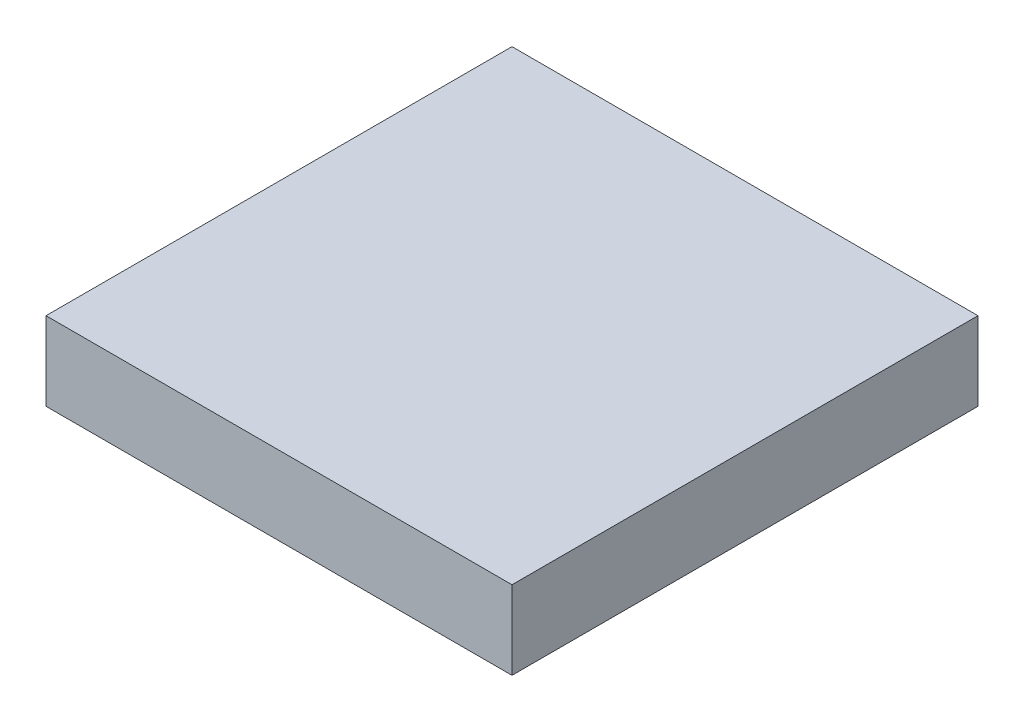
ISO-10303-21;
HEADER;
FILE_DESCRIPTION(('STEP AP214'),'2;1');
FILE_NAME('part.step','',(''),(''),'','','');
FILE_SCHEMA(('AUTOMOTIVE_DESIGN { 1 0 10303 214 1 1 1 1 }'));
ENDSEC;
DATA;
#1=APPLICATION_CONTEXT('core data for automotive mechanical design processes');
#2=APPLICATION_PROTOCOL_DEFINITION('international standard','automotive_design',2000,#1);
#3=PRODUCT_CONTEXT('',#1,'mechanical');
#4=PRODUCT('Part','Part','',(#3));
#5=PRODUCT_RELATED_PRODUCT_CATEGORY('part','',(#4));
#6=PRODUCT_DEFINITION_FORMATION('','',#4);
#7=PRODUCT_DEFINITION_CONTEXT('part definition',#1,'design');
#8=PRODUCT_DEFINITION('design','',#6,#7);
#9=PRODUCT_DEFINITION_SHAPE('','',#8);
#10=(LENGTH_UNIT() NAMED_UNIT(*) SI_UNIT(.MILLI.,.METRE.));
#11=(NAMED_UNIT(*) PLANE_ANGLE_UNIT() SI_UNIT($,.RADIAN.));
#12=(NAMED_UNIT(*) SI_UNIT($,.STERADIAN.) SOLID_ANGLE_UNIT());
#13=UNCERTAINTY_MEASURE_WITH_UNIT(LENGTH_MEASURE(1.E-05),#10,'distance_accuracy_value','');
#14=(GEOMETRIC_REPRESENTATION_CONTEXT(3) GLOBAL_UNCERTAINTY_ASSIGNED_CONTEXT((#13)) GLOBAL_UNIT_ASSIGNED_CONTEXT((#10,
#11,#12)) REPRESENTATION_CONTEXT('',''));
#15=CARTESIAN_POINT('',(0.,0.,0.));
#16=DIRECTION('',(0.,0.,1.));
#17=DIRECTION('',(1.,0.,0.));
#18=AXIS2_PLACEMENT_3D('',#15,#16,#17);
#19=CARTESIAN_POINT('',(363.498182619916,99.4218000310896,7.34009304640788));
#20=DIRECTION('',(1.,0.,0.));
#21=DIRECTION('',(0.,0.,-1.));
#22=AXIS2_PLACEMENT_3D('',#19,#20,#21);
#23=PLANE('',#22);
#24=DIRECTION('',(0.,0.,1.));
#25=VECTOR('',#24,1.);
#26=CARTESIAN_POINT('',(363.498182619916,90.5892800165049,7.34009304640788));
#27=LINE('',#26,#25);
#28=CARTESIAN_POINT('',(363.498182619916,90.5892800165049,7.34009304640788));
#29=VERTEX_POINT('',#28);
#30=CARTESIAN_POINT('',(363.498182619916,90.5892800165049,59.7825908800285));
#31=VERTEX_POINT('',#30);
#32=EDGE_CURVE('E79',#29,#31,#27,.T.);
#33=ORIENTED_EDGE('',*,*,#32,.F.);
#34=DIRECTION('',(0.,-1.,0.));
#35=VECTOR('',#34,1.);
#36=CARTESIAN_POINT('',(363.498182619916,99.4218000310896,7.34009304640788));
#37=LINE('',#36,#35);
#38=CARTESIAN_POINT('',(363.498182619916,99.4218000310896,7.34009304640788));
#39=VERTEX_POINT('',#38);
#40=EDGE_CURVE('E32',#39,#29,#37,.T.);
#41=ORIENTED_EDGE('',*,*,#40,.F.);
#42=DIRECTION('',(0.,0.,1.));
#43=VECTOR('',#42,1.);
#44=CARTESIAN_POINT('',(363.498182619916,99.4218000310896,7.34009304640788));
#45=LINE('',#44,#43);
#46=CARTESIAN_POINT('',(363.498182619916,99.4218000310896,59.7825908800285));
#47=VERTEX_POINT('',#46);
#48=EDGE_CURVE('E71',#39,#47,#45,.T.);
#49=ORIENTED_EDGE('',*,*,#48,.T.);
#50=DIRECTION('',(0.,-1.,0.));
#51=VECTOR('',#50,1.);
#52=CARTESIAN_POINT('',(363.498182619916,99.4218000310896,59.7825908800285));
#53=LINE('',#52,#51);
#54=EDGE_CURVE('E10',#47,#31,#53,.T.);
#55=ORIENTED_EDGE('',*,*,#54,.T.);
#56=EDGE_LOOP('',(#33,#41,#49,#55));
#57=FACE_BOUND('',#56,.T.);
#58=ADVANCED_FACE('F16',(#57),#23,.T.);
#59=CARTESIAN_POINT('',(363.498182619916,99.4218000310896,59.7825908800285));
#60=DIRECTION('',(0.,0.,1.));
#61=DIRECTION('',(1.,0.,0.));
#62=AXIS2_PLACEMENT_3D('',#59,#60,#61);
#63=PLANE('',#62);
#64=DIRECTION('',(-1.,0.,0.));
#65=VECTOR('',#64,1.);
#66=CARTESIAN_POINT('',(363.498182619916,90.5892800165049,59.7825908800285));
#67=LINE('',#66,#65);
#68=CARTESIAN_POINT('',(311.055684786296,90.5892800165049,59.7825908800285));
#69=VERTEX_POINT('',#68);
#70=EDGE_CURVE('E82',#31,#69,#67,.T.);
#71=ORIENTED_EDGE('',*,*,#70,.F.);
#72=ORIENTED_EDGE('',*,*,#54,.F.);
#73=DIRECTION('',(-1.,0.,0.));
#74=VECTOR('',#73,1.);
#75=CARTESIAN_POINT('',(363.498182619916,99.4218000310896,59.7825908800285));
#76=LINE('',#75,#74);
#77=CARTESIAN_POINT('',(311.055684786296,99.4218000310896,59.7825908800285));
#78=VERTEX_POINT('',#77);
#79=EDGE_CURVE('E67',#47,#78,#76,.T.);
#80=ORIENTED_EDGE('',*,*,#79,.T.);
#81=DIRECTION('',(0.,-1.,0.));
#82=VECTOR('',#81,1.);
#83=CARTESIAN_POINT('',(311.055684786296,99.4218000310896,59.7825908800285));
#84=LINE('',#83,#82);
#85=EDGE_CURVE('E24',#78,#69,#84,.T.);
#86=ORIENTED_EDGE('',*,*,#85,.T.);
#87=EDGE_LOOP('',(#71,#72,#80,#86));
#88=FACE_BOUND('',#87,.T.);
#89=ADVANCED_FACE('F68',(#88),#63,.T.);
#90=CARTESIAN_POINT('',(311.055684786296,99.4218000310896,59.7825908800285));
#91=DIRECTION('',(-1.,0.,0.));
#92=DIRECTION('',(0.,0.,1.));
#93=AXIS2_PLACEMENT_3D('',#90,#91,#92);
#94=PLANE('',#93);
#95=DIRECTION('',(0.,0.,-1.));
#96=VECTOR('',#95,1.);
#97=CARTESIAN_POINT('',(311.055684786296,90.5892800165049,59.7825908800285));
#98=LINE('',#97,#96);
#99=CARTESIAN_POINT('',(311.055684786296,90.5892800165049,7.34009304640791));
#100=VERTEX_POINT('',#99);
#101=EDGE_CURVE('E65',#69,#100,#98,.T.);
#102=ORIENTED_EDGE('',*,*,#101,.F.);
#103=ORIENTED_EDGE('',*,*,#85,.F.);
#104=DIRECTION('',(0.,0.,-1.));
#105=VECTOR('',#104,1.);
#106=CARTESIAN_POINT('',(311.055684786296,99.4218000310896,59.7825908800285));
#107=LINE('',#106,#105);
#108=CARTESIAN_POINT('',(311.055684786296,99.4218000310896,7.34009304640791));
#109=VERTEX_POINT('',#108);
#110=EDGE_CURVE('E62',#78,#109,#107,.T.);
#111=ORIENTED_EDGE('',*,*,#110,.T.);
#112=DIRECTION('',(0.,-1.,0.));
#113=VECTOR('',#112,1.);
#114=CARTESIAN_POINT('',(311.055684786296,99.4218000310896,7.34009304640791));
#115=LINE('',#114,#113);
#116=EDGE_CURVE('E48',#109,#100,#115,.T.);
#117=ORIENTED_EDGE('',*,*,#116,.T.);
#118=EDGE_LOOP('',(#102,#103,#111,#117));
#119=FACE_BOUND('',#118,.T.);
#120=ADVANCED_FACE('F60',(#119),#94,.T.);
#121=CARTESIAN_POINT('',(311.055684786296,99.4218000310896,7.34009304640791));
#122=DIRECTION('',(0.,0.,-1.));
#123=DIRECTION('',(-1.,0.,0.));
#124=AXIS2_PLACEMENT_3D('',#121,#122,#123);
#125=PLANE('',#124);
#126=DIRECTION('',(1.,0.,0.));
#127=VECTOR('',#126,1.);
#128=CARTESIAN_POINT('',(311.055684786296,90.5892800165049,7.34009304640791));
#129=LINE('',#128,#127);
#130=EDGE_CURVE('E85',#100,#29,#129,.T.);
#131=ORIENTED_EDGE('',*,*,#130,.F.);
#132=ORIENTED_EDGE('',*,*,#116,.F.);
#133=DIRECTION('',(1.,0.,0.));
#134=VECTOR('',#133,1.);
#135=CARTESIAN_POINT('',(311.055684786296,99.4218000310896,7.34009304640791));
#136=LINE('',#135,#134);
#137=EDGE_CURVE('E74',#109,#39,#136,.T.);
#138=ORIENTED_EDGE('',*,*,#137,.T.);
#139=ORIENTED_EDGE('',*,*,#40,.T.);
#140=EDGE_LOOP('',(#131,#132,#138,#139));
#141=FACE_BOUND('',#140,.T.);
#142=ADVANCED_FACE('F96',(#141),#125,.T.);
#143=CARTESIAN_POINT('',(224.776933703106,99.4218000310896,33.5613419632182));
#144=DIRECTION('',(0.,-1.,0.));
#145=DIRECTION('',(1.,0.,0.));
#146=AXIS2_PLACEMENT_3D('',#143,#144,#145);
#147=PLANE('',#146);
#148=ORIENTED_EDGE('',*,*,#48,.F.);
#149=ORIENTED_EDGE('',*,*,#137,.F.);
#150=ORIENTED_EDGE('',*,*,#110,.F.);
#151=ORIENTED_EDGE('',*,*,#79,.F.);
#152=EDGE_LOOP('',(#148,#149,#150,#151));
#153=FACE_BOUND('',#152,.T.);
#154=ADVANCED_FACE('F73',(#153),#147,.F.);
#155=CARTESIAN_POINT('',(224.776933703106,90.5892800165049,33.5613419632182));
#156=DIRECTION('',(0.,-1.,0.));
#157=DIRECTION('',(1.,0.,0.));
#158=AXIS2_PLACEMENT_3D('',#155,#156,#157);
#159=PLANE('',#158);
#160=ORIENTED_EDGE('',*,*,#32,.T.);
#161=ORIENTED_EDGE('',*,*,#70,.T.);
#162=ORIENTED_EDGE('',*,*,#101,.T.);
#163=ORIENTED_EDGE('',*,*,#130,.T.);
#164=EDGE_LOOP('',(#160,#161,#162,#163));
#165=FACE_BOUND('',#164,.T.);
#166=ADVANCED_FACE('F89',(#165),#159,.T.);
#167=CLOSED_SHELL('',(#58,#89,#120,#142,#154,#166));
#168=MANIFOLD_SOLID_BREP('B1',#167);
#169=ADVANCED_BREP_SHAPE_REPRESENTATION('',(#18,#168),#14);
#170=SHAPE_DEFINITION_REPRESENTATION(#9,#169);
ENDSEC;
END-ISO-10303-21;
